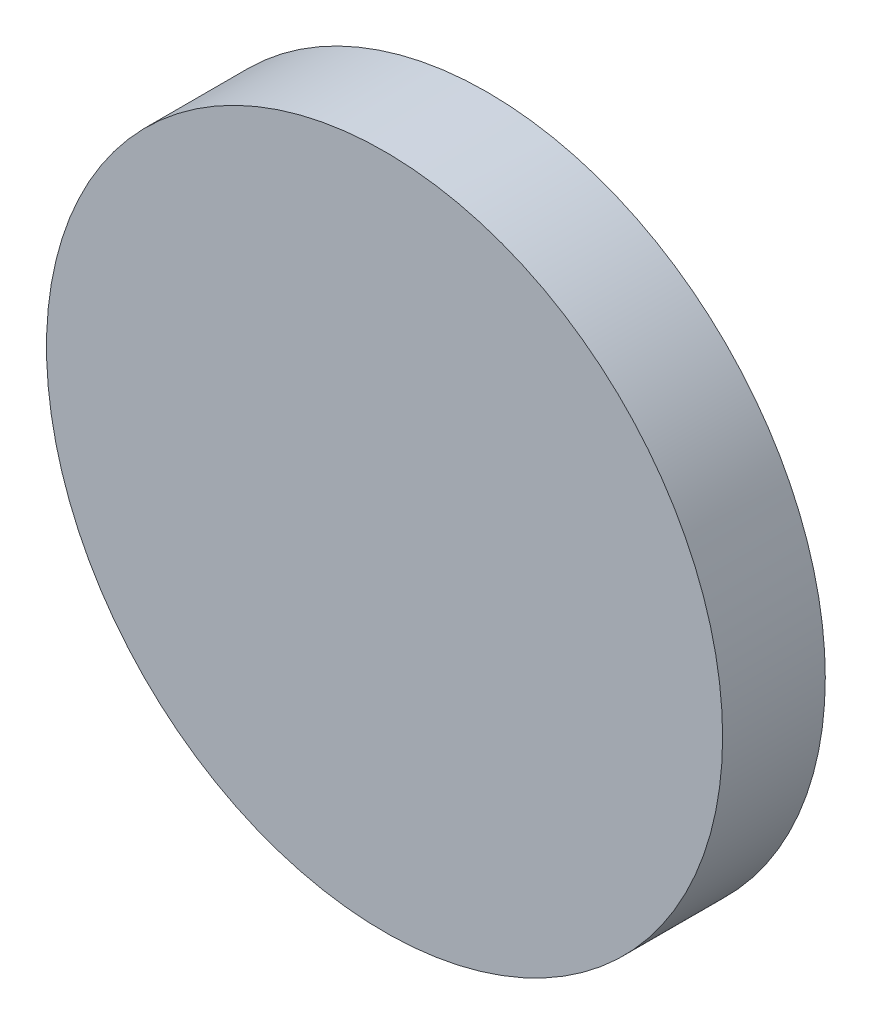
ISO-10303-21;
HEADER;
FILE_DESCRIPTION(('STEP AP214'),'2;1');
FILE_NAME('part.step','',(''),(''),'','','');
FILE_SCHEMA(('AUTOMOTIVE_DESIGN { 1 0 10303 214 1 1 1 1 }'));
ENDSEC;
DATA;
#1=APPLICATION_CONTEXT('core data for automotive mechanical design processes');
#2=APPLICATION_PROTOCOL_DEFINITION('international standard','automotive_design',2000,#1);
#3=PRODUCT_CONTEXT('',#1,'mechanical');
#4=PRODUCT('Part','Part','',(#3));
#5=PRODUCT_RELATED_PRODUCT_CATEGORY('part','',(#4));
#6=PRODUCT_DEFINITION_FORMATION('','',#4);
#7=PRODUCT_DEFINITION_CONTEXT('part definition',#1,'design');
#8=PRODUCT_DEFINITION('design','',#6,#7);
#9=PRODUCT_DEFINITION_SHAPE('','',#8);
#10=(LENGTH_UNIT() NAMED_UNIT(*) SI_UNIT(.MILLI.,.METRE.));
#11=(NAMED_UNIT(*) PLANE_ANGLE_UNIT() SI_UNIT($,.RADIAN.));
#12=(NAMED_UNIT(*) SI_UNIT($,.STERADIAN.) SOLID_ANGLE_UNIT());
#13=UNCERTAINTY_MEASURE_WITH_UNIT(LENGTH_MEASURE(1.E-05),#10,'distance_accuracy_value','');
#14=(GEOMETRIC_REPRESENTATION_CONTEXT(3) GLOBAL_UNCERTAINTY_ASSIGNED_CONTEXT((#13)) GLOBAL_UNIT_ASSIGNED_CONTEXT((#10,
#11,#12)) REPRESENTATION_CONTEXT('',''));
#15=CARTESIAN_POINT('',(0.,0.,0.));
#16=DIRECTION('',(0.,0.,1.));
#17=DIRECTION('',(1.,0.,0.));
#18=AXIS2_PLACEMENT_3D('',#15,#16,#17);
#19=CARTESIAN_POINT('',(0.,26.112,5.));
#20=DIRECTION('',(0.,0.,1.));
#21=DIRECTION('',(1.,0.,0.));
#22=AXIS2_PLACEMENT_3D('',#19,#20,#21);
#23=PLANE('',#22);
#24=CARTESIAN_POINT('',(0.,0.,5.));
#25=DIRECTION('',(0.,0.,1.));
#26=DIRECTION('',(1.,0.,0.));
#27=AXIS2_PLACEMENT_3D('',#24,#25,#26);
#28=CIRCLE('',#27,12.7);
#29=CARTESIAN_POINT('',(12.7,0.,5.));
#30=VERTEX_POINT('',#29);
#31=EDGE_CURVE('E19',#30,#30,#28,.F.);
#32=ORIENTED_EDGE('',*,*,#31,.F.);
#33=EDGE_LOOP('',(#32));
#34=FACE_BOUND('',#33,.T.);
#35=ADVANCED_FACE('F16',(#34),#23,.T.);
#36=CARTESIAN_POINT('',(0.,0.,1.14282464237587));
#37=DIRECTION('',(0.,0.,1.));
#38=DIRECTION('',(1.,0.,0.));
#39=AXIS2_PLACEMENT_3D('',#36,#37,#38);
#40=CYLINDRICAL_SURFACE('',#39,12.7);
#41=ORIENTED_EDGE('',*,*,#31,.T.);
#42=EDGE_LOOP('',(#41));
#43=FACE_BOUND('',#42,.T.);
#44=CARTESIAN_POINT('',(0.,0.,1.14282464237587));
#45=DIRECTION('',(0.,0.,-1.));
#46=DIRECTION('',(-1.,0.,0.));
#47=AXIS2_PLACEMENT_3D('',#44,#45,#46);
#48=CIRCLE('',#47,12.7);
#49=CARTESIAN_POINT('',(-12.7,0.,1.14282464237587));
#50=VERTEX_POINT('',#49);
#51=EDGE_CURVE('E10',#50,#50,#48,.T.);
#52=ORIENTED_EDGE('',*,*,#51,.F.);
#53=EDGE_LOOP('',(#52));
#54=FACE_BOUND('',#53,.T.);
#55=ADVANCED_FACE('F27',(#43,#54),#40,.T.);
#56=CARTESIAN_POINT('',(0.,12.7,1.14282464237587));
#57=CARTESIAN_POINT('',(-12.7,12.7,1.14282464237587));
#58=CARTESIAN_POINT('',(-12.7,0.,1.14282464237587));
#59=CARTESIAN_POINT('',(-12.7,-12.7,1.14282464237587));
#60=CARTESIAN_POINT('',(0.,-12.7,1.14282464237587));
#61=CARTESIAN_POINT('',(12.7,-12.7,1.14282464237587));
#62=CARTESIAN_POINT('',(12.7,0.,1.14282464237587));
#63=CARTESIAN_POINT('',(12.7,12.7,1.14282464237587));
#64=CARTESIAN_POINT('',(0.,12.7,1.14282464237587));
#65=CARTESIAN_POINT('',(0.,11.4704314604101,0.922898014882742));
#66=CARTESIAN_POINT('',(-11.4704314604101,11.4704314604101,0.922898014882742));
#67=CARTESIAN_POINT('',(-11.4704314604101,0.,0.922898014882742));
#68=CARTESIAN_POINT('',(-11.4704314604101,-11.4704314604101,0.922898014882742));
#69=CARTESIAN_POINT('',(0.,-11.4704314604101,0.922898014882742));
#70=CARTESIAN_POINT('',(11.4704314604101,-11.4704314604101,0.922898014882742));
#71=CARTESIAN_POINT('',(11.4704314604101,0.,0.922898014882742));
#72=CARTESIAN_POINT('',(11.4704314604101,11.4704314604101,0.922898014882742));
#73=CARTESIAN_POINT('',(0.,11.4704314604101,0.922898014882742));
#74=CARTESIAN_POINT('',(0.,10.059711443628,0.70619875700289));
#75=CARTESIAN_POINT('',(-10.059711443628,10.059711443628,0.70619875700289));
#76=CARTESIAN_POINT('',(-10.059711443628,0.,0.70619875700289));
#77=CARTESIAN_POINT('',(-10.059711443628,-10.059711443628,0.70619875700289));
#78=CARTESIAN_POINT('',(0.,-10.059711443628,0.70619875700289));
#79=CARTESIAN_POINT('',(10.059711443628,-10.059711443628,0.70619875700289));
#80=CARTESIAN_POINT('',(10.059711443628,0.,0.70619875700289));
#81=CARTESIAN_POINT('',(10.059711443628,10.059711443628,0.70619875700289));
#82=CARTESIAN_POINT('',(0.,10.059711443628,0.70619875700289));
#83=CARTESIAN_POINT('',(0.,8.29124422036897,0.48729085289781));
#84=CARTESIAN_POINT('',(-8.29124422036897,8.29124422036897,0.48729085289781));
#85=CARTESIAN_POINT('',(-8.29124422036897,0.,0.48729085289781));
#86=CARTESIAN_POINT('',(-8.29124422036897,-8.29124422036897,0.48729085289781));
#87=CARTESIAN_POINT('',(0.,-8.29124422036897,0.48729085289781));
#88=CARTESIAN_POINT('',(8.29124422036897,-8.29124422036897,0.48729085289781));
#89=CARTESIAN_POINT('',(8.29124422036897,0.,0.48729085289781));
#90=CARTESIAN_POINT('',(8.29124422036897,8.29124422036897,0.48729085289781));
#91=CARTESIAN_POINT('',(0.,8.29124422036897,0.48729085289781));
#92=CARTESIAN_POINT('',(0.,7.05782045329338,0.348333920586286));
#93=CARTESIAN_POINT('',(-7.05782045329338,7.05782045329338,0.348333920586286));
#94=CARTESIAN_POINT('',(-7.05782045329338,0.,0.348333920586286));
#95=CARTESIAN_POINT('',(-7.05782045329338,-7.05782045329338,0.348333920586286));
#96=CARTESIAN_POINT('',(0.,-7.05782045329338,0.348333920586286));
#97=CARTESIAN_POINT('',(7.05782045329337,-7.05782045329338,0.348333920586286));
#98=CARTESIAN_POINT('',(7.05782045329338,0.,0.348333920586286));
#99=CARTESIAN_POINT('',(7.05782045329338,7.05782045329337,0.348333920586286));
#100=CARTESIAN_POINT('',(0.,7.05782045329338,0.348333920586286));
#101=CARTESIAN_POINT('',(0.,5.64618692466057,0.220818761647685));
#102=CARTESIAN_POINT('',(-5.64618692466057,5.64618692466057,0.220818761647685));
#103=CARTESIAN_POINT('',(-5.64618692466057,0.,0.220818761647685));
#104=CARTESIAN_POINT('',(-5.64618692466057,-5.64618692466057,0.220818761647685));
#105=CARTESIAN_POINT('',(0.,-5.64618692466057,0.220818761647685));
#106=CARTESIAN_POINT('',(5.64618692466057,-5.64618692466057,0.220818761647685));
#107=CARTESIAN_POINT('',(5.64618692466057,0.,0.220818761647685));
#108=CARTESIAN_POINT('',(5.64618692466057,5.64618692466057,0.220818761647685));
#109=CARTESIAN_POINT('',(0.,5.64618692466057,0.220818761647685));
#110=CARTESIAN_POINT('',(0.,3.88184636343356,0.101188074000454));
#111=CARTESIAN_POINT('',(-3.88184636343356,3.88184636343356,0.101188074000454));
#112=CARTESIAN_POINT('',(-3.88184636343356,0.,0.101188074000454));
#113=CARTESIAN_POINT('',(-3.88184636343356,-3.88184636343356,0.101188074000454));
#114=CARTESIAN_POINT('',(0.,-3.88184636343356,0.101188074000454));
#115=CARTESIAN_POINT('',(3.88184636343356,-3.88184636343356,0.101188074000454));
#116=CARTESIAN_POINT('',(3.88184636343356,0.,0.101188074000454));
#117=CARTESIAN_POINT('',(3.88184636343356,3.88184636343355,0.101188074000454));
#118=CARTESIAN_POINT('',(0.,3.88184636343356,0.101188074000454));
#119=CARTESIAN_POINT('',(0.,2.11768190228806,0.0213231692128077));
#120=CARTESIAN_POINT('',(-2.11768190228806,2.11768190228806,0.0213231692128077));
#121=CARTESIAN_POINT('',(-2.11768190228806,0.,0.0213231692128077));
#122=CARTESIAN_POINT('',(-2.11768190228806,-2.11768190228806,0.0213231692128077));
#123=CARTESIAN_POINT('',(0.,-2.11768190228806,0.0213231692128077));
#124=CARTESIAN_POINT('',(2.11768190228806,-2.11768190228806,0.0213231692128077));
#125=CARTESIAN_POINT('',(2.11768190228806,0.,0.0213231692128077));
#126=CARTESIAN_POINT('',(2.11768190228806,2.11768190228806,0.0213231692128077));
#127=CARTESIAN_POINT('',(0.,2.11768190228806,0.0213231692128077));
#128=CARTESIAN_POINT('',(0.,0.705690985017707,0.));
#129=CARTESIAN_POINT('',(-0.705690985017707,0.705690985017707,0.));
#130=CARTESIAN_POINT('',(-0.705690985017707,0.,0.));
#131=CARTESIAN_POINT('',(-0.705690985017707,-0.705690985017707,0.));
#132=CARTESIAN_POINT('',(0.,-0.705690985017707,0.));
#133=CARTESIAN_POINT('',(0.705690985017707,-0.705690985017707,0.));
#134=CARTESIAN_POINT('',(0.705690985017707,0.,0.));
#135=CARTESIAN_POINT('',(0.705690985017707,0.705690985017707,0.));
#136=CARTESIAN_POINT('',(0.,0.705690985017707,0.));
#137=CARTESIAN_POINT('',(0.,0.,0.));
#138=CARTESIAN_POINT('',(0.,0.,0.));
#139=CARTESIAN_POINT('',(0.,0.,0.));
#140=CARTESIAN_POINT('',(0.,0.,0.));
#141=CARTESIAN_POINT('',(0.,0.,0.));
#142=CARTESIAN_POINT('',(0.,0.,0.));
#143=CARTESIAN_POINT('',(0.,0.,0.));
#144=CARTESIAN_POINT('',(0.,0.,0.));
#145=CARTESIAN_POINT('',(0.,0.,0.));
#146=(BOUNDED_SURFACE() B_SPLINE_SURFACE(3,2,((#56,#57,#58,#59,#60,#61,#62,#63,#64),(#65,#66,
#67,#68,#69,#70,#71,#72,#73),(#74,#75,#76,#77,#78,#79,#80,#81,#82),(#83,#84,#85,#86,#87,#88,#89,
#90,#91),(#92,#93,#94,#95,#96,#97,#98,#99,#100),(#101,#102,#103,#104,#105,#106,#107,#108,#109),
(#110,#111,#112,#113,#114,#115,#116,#117,#118),(#119,#120,#121,#122,#123,#124,#125,#126,#127),
(#128,#129,#130,#131,#132,#133,#134,#135,#136),(#137,#138,#139,#140,#141,#142,#143,#144,#145)),
.UNSPECIFIED.,.F.,.T.,.F.) B_SPLINE_SURFACE_WITH_KNOTS((4,1,1,1,1,1,1,4),(3,2,2,2,3),(0.,
0.293491874817754,0.335253492377033,0.41867327246128,0.585138863219807,0.668225030771442,
0.834186606154636,1.),(0.,90.,180.,270.,360.),
.UNSPECIFIED.) GEOMETRIC_REPRESENTATION_ITEM() RATIONAL_B_SPLINE_SURFACE(((1.,0.707106781186548,
1.,0.707106781186548,1.,0.707106781186548,1.,0.707106781186548,1.),(1.,0.707106781186548,1.,
0.707106781186548,1.,0.707106781186548,1.,0.707106781186548,1.),(1.,0.707106781186548,1.,
0.707106781186548,1.,0.707106781186548,1.,0.707106781186548,1.),(1.,0.707106781186548,1.,
0.707106781186548,1.,0.707106781186548,1.,0.707106781186548,1.),(1.,0.707106781186548,1.,
0.707106781186548,1.,0.707106781186548,1.,0.707106781186548,1.),(1.,0.707106781186548,1.,
0.707106781186548,1.,0.707106781186548,1.,0.707106781186548,1.),(1.,0.707106781186548,1.,
0.707106781186548,1.,0.707106781186548,1.,0.707106781186548,1.),(1.,0.707106781186548,1.,
0.707106781186548,1.,0.707106781186548,1.,0.707106781186548,1.),(1.,0.707106781186548,1.,
0.707106781186548,1.,0.707106781186548,1.,0.707106781186548,1.),(1.,0.707106781186548,1.,
0.707106781186548,1.,0.707106781186548,1.,0.707106781186548,1.))) REPRESENTATION_ITEM('') SURFACE());
#147=ORIENTED_EDGE('',*,*,#51,.T.);
#148=EDGE_LOOP('',(#147));
#149=FACE_BOUND('',#148,.T.);
#150=CARTESIAN_POINT('',(0.,0.,0.));
#151=VERTEX_POINT('',#150);
#152=VERTEX_LOOP('',#151);
#153=FACE_BOUND('',#152,.T.);
#154=ADVANCED_FACE('F25',(#149,#153),#146,.T.);
#155=CLOSED_SHELL('',(#35,#55,#154));
#156=MANIFOLD_SOLID_BREP('B1',#155);
#157=ADVANCED_BREP_SHAPE_REPRESENTATION('',(#18,#156),#14);
#158=SHAPE_DEFINITION_REPRESENTATION(#9,#157);
ENDSEC;
END-ISO-10303-21;
